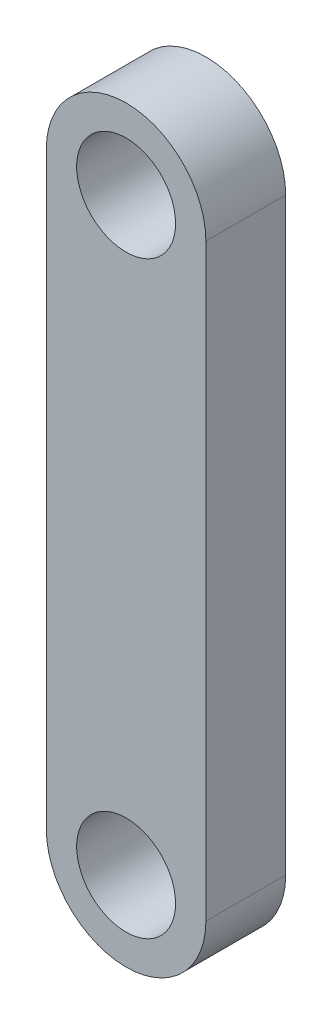
ISO-10303-21;
HEADER;
FILE_DESCRIPTION(('STEP AP214'),'2;1');
FILE_NAME('part.step','',(''),(''),'','','');
FILE_SCHEMA(('AUTOMOTIVE_DESIGN { 1 0 10303 214 1 1 1 1 }'));
ENDSEC;
DATA;
#1=APPLICATION_CONTEXT('core data for automotive mechanical design processes');
#2=APPLICATION_PROTOCOL_DEFINITION('international standard','automotive_design',2000,#1);
#3=PRODUCT_CONTEXT('',#1,'mechanical');
#4=PRODUCT('Part','Part','',(#3));
#5=PRODUCT_RELATED_PRODUCT_CATEGORY('part','',(#4));
#6=PRODUCT_DEFINITION_FORMATION('','',#4);
#7=PRODUCT_DEFINITION_CONTEXT('part definition',#1,'design');
#8=PRODUCT_DEFINITION('design','',#6,#7);
#9=PRODUCT_DEFINITION_SHAPE('','',#8);
#10=(LENGTH_UNIT() NAMED_UNIT(*) SI_UNIT(.MILLI.,.METRE.));
#11=(NAMED_UNIT(*) PLANE_ANGLE_UNIT() SI_UNIT($,.RADIAN.));
#12=(NAMED_UNIT(*) SI_UNIT($,.STERADIAN.) SOLID_ANGLE_UNIT());
#13=UNCERTAINTY_MEASURE_WITH_UNIT(LENGTH_MEASURE(1.E-05),#10,'distance_accuracy_value','');
#14=(GEOMETRIC_REPRESENTATION_CONTEXT(3) GLOBAL_UNCERTAINTY_ASSIGNED_CONTEXT((#13)) GLOBAL_UNIT_ASSIGNED_CONTEXT((#10,
#11,#12)) REPRESENTATION_CONTEXT('',''));
#15=CARTESIAN_POINT('',(0.,0.,0.));
#16=DIRECTION('',(0.,0.,1.));
#17=DIRECTION('',(1.,0.,0.));
#18=AXIS2_PLACEMENT_3D('',#15,#16,#17);
#19=CARTESIAN_POINT('',(0.,33.5030020317063,6.35));
#20=DIRECTION('',(0.,0.,1.));
#21=DIRECTION('',(1.,0.,0.));
#22=AXIS2_PLACEMENT_3D('',#19,#20,#21);
#23=PLANE('',#22);
#24=CARTESIAN_POINT('',(0.,33.5030020317063,6.35));
#25=DIRECTION('',(0.,0.,1.));
#26=DIRECTION('',(1.,0.,0.));
#27=AXIS2_PLACEMENT_3D('',#24,#25,#26);
#28=CIRCLE('',#27,3.937);
#29=CARTESIAN_POINT('',(3.937,33.5030020317063,6.35));
#30=VERTEX_POINT('',#29);
#31=EDGE_CURVE('E99',#30,#30,#28,.T.);
#32=ORIENTED_EDGE('',*,*,#31,.F.);
#33=EDGE_LOOP('',(#32));
#34=FACE_BOUND('',#33,.T.);
#35=CARTESIAN_POINT('',(0.,33.5030020317063,6.35));
#36=DIRECTION('',(0.,0.,1.));
#37=DIRECTION('',(1.,0.,0.));
#38=AXIS2_PLACEMENT_3D('',#35,#36,#37);
#39=CIRCLE('',#38,6.35);
#40=CARTESIAN_POINT('',(6.35,33.5030020317063,6.35));
#41=VERTEX_POINT('',#40);
#42=CARTESIAN_POINT('',(-6.35,33.5030020317063,6.35));
#43=VERTEX_POINT('',#42);
#44=EDGE_CURVE('E84',#41,#43,#39,.T.);
#45=ORIENTED_EDGE('',*,*,#44,.T.);
#46=DIRECTION('',(0.,-1.,0.));
#47=VECTOR('',#46,1.);
#48=CARTESIAN_POINT('',(-6.35,33.5030020317063,6.35));
#49=LINE('',#48,#47);
#50=CARTESIAN_POINT('',(-6.35,-13.3599979682937,6.35));
#51=VERTEX_POINT('',#50);
#52=EDGE_CURVE('E79',#43,#51,#49,.T.);
#53=ORIENTED_EDGE('',*,*,#52,.T.);
#54=CARTESIAN_POINT('',(0.,-13.3599979682937,6.35));
#55=DIRECTION('',(0.,0.,1.));
#56=DIRECTION('',(1.,0.,0.));
#57=AXIS2_PLACEMENT_3D('',#54,#55,#56);
#58=CIRCLE('',#57,6.35);
#59=CARTESIAN_POINT('',(6.35,-13.3599979682937,6.35));
#60=VERTEX_POINT('',#59);
#61=EDGE_CURVE('E82',#51,#60,#58,.T.);
#62=ORIENTED_EDGE('',*,*,#61,.T.);
#63=DIRECTION('',(0.,1.,0.));
#64=VECTOR('',#63,1.);
#65=CARTESIAN_POINT('',(6.35,33.5030020317063,6.35));
#66=LINE('',#65,#64);
#67=EDGE_CURVE('E49',#60,#41,#66,.T.);
#68=ORIENTED_EDGE('',*,*,#67,.T.);
#69=EDGE_LOOP('',(#45,#53,#62,#68));
#70=FACE_BOUND('',#69,.T.);
#71=CARTESIAN_POINT('',(0.,-13.3599979682937,6.35));
#72=DIRECTION('',(0.,0.,1.));
#73=DIRECTION('',(1.,0.,0.));
#74=AXIS2_PLACEMENT_3D('',#71,#72,#73);
#75=CIRCLE('',#74,3.937);
#76=CARTESIAN_POINT('',(3.937,-13.3599979682937,6.35));
#77=VERTEX_POINT('',#76);
#78=EDGE_CURVE('E114',#77,#77,#75,.T.);
#79=ORIENTED_EDGE('',*,*,#78,.F.);
#80=EDGE_LOOP('',(#79));
#81=FACE_BOUND('',#80,.T.);
#82=ADVANCED_FACE('F32',(#34,#70,#81),#23,.T.);
#83=CARTESIAN_POINT('',(0.,33.5030020317063,0.));
#84=DIRECTION('',(0.,0.,1.));
#85=DIRECTION('',(1.,0.,0.));
#86=AXIS2_PLACEMENT_3D('',#83,#84,#85);
#87=PLANE('',#86);
#88=CARTESIAN_POINT('',(0.,33.5030020317063,0.));
#89=DIRECTION('',(0.,0.,1.));
#90=DIRECTION('',(1.,0.,0.));
#91=AXIS2_PLACEMENT_3D('',#88,#89,#90);
#92=CIRCLE('',#91,6.35);
#93=CARTESIAN_POINT('',(6.35,33.5030020317063,0.));
#94=VERTEX_POINT('',#93);
#95=CARTESIAN_POINT('',(-6.35,33.5030020317063,0.));
#96=VERTEX_POINT('',#95);
#97=EDGE_CURVE('E96',#94,#96,#92,.T.);
#98=ORIENTED_EDGE('',*,*,#97,.F.);
#99=DIRECTION('',(0.,1.,0.));
#100=VECTOR('',#99,1.);
#101=CARTESIAN_POINT('',(6.35,33.5030020317063,0.));
#102=LINE('',#101,#100);
#103=CARTESIAN_POINT('',(6.35,-13.3599979682937,0.));
#104=VERTEX_POINT('',#103);
#105=EDGE_CURVE('E72',#104,#94,#102,.T.);
#106=ORIENTED_EDGE('',*,*,#105,.F.);
#107=CARTESIAN_POINT('',(0.,-13.3599979682937,0.));
#108=DIRECTION('',(0.,0.,1.));
#109=DIRECTION('',(1.,0.,0.));
#110=AXIS2_PLACEMENT_3D('',#107,#108,#109);
#111=CIRCLE('',#110,6.35);
#112=CARTESIAN_POINT('',(-6.35,-13.3599979682937,0.));
#113=VERTEX_POINT('',#112);
#114=EDGE_CURVE('E66',#113,#104,#111,.T.);
#115=ORIENTED_EDGE('',*,*,#114,.F.);
#116=DIRECTION('',(0.,-1.,0.));
#117=VECTOR('',#116,1.);
#118=CARTESIAN_POINT('',(-6.35,33.5030020317063,0.));
#119=LINE('',#118,#117);
#120=EDGE_CURVE('E88',#96,#113,#119,.T.);
#121=ORIENTED_EDGE('',*,*,#120,.F.);
#122=EDGE_LOOP('',(#98,#106,#115,#121));
#123=FACE_BOUND('',#122,.T.);
#124=CARTESIAN_POINT('',(0.,33.5030020317063,0.));
#125=DIRECTION('',(0.,0.,1.));
#126=DIRECTION('',(1.,0.,0.));
#127=AXIS2_PLACEMENT_3D('',#124,#125,#126);
#128=CIRCLE('',#127,3.937);
#129=CARTESIAN_POINT('',(3.937,33.5030020317063,0.));
#130=VERTEX_POINT('',#129);
#131=EDGE_CURVE('E111',#130,#130,#128,.T.);
#132=ORIENTED_EDGE('',*,*,#131,.T.);
#133=EDGE_LOOP('',(#132));
#134=FACE_BOUND('',#133,.T.);
#135=CARTESIAN_POINT('',(0.,-13.3599979682937,0.));
#136=DIRECTION('',(0.,0.,1.));
#137=DIRECTION('',(1.,0.,0.));
#138=AXIS2_PLACEMENT_3D('',#135,#136,#137);
#139=CIRCLE('',#138,3.937);
#140=CARTESIAN_POINT('',(3.937,-13.3599979682937,0.));
#141=VERTEX_POINT('',#140);
#142=EDGE_CURVE('E117',#141,#141,#139,.T.);
#143=ORIENTED_EDGE('',*,*,#142,.T.);
#144=EDGE_LOOP('',(#143));
#145=FACE_BOUND('',#144,.T.);
#146=ADVANCED_FACE('F107',(#123,#134,#145),#87,.F.);
#147=CARTESIAN_POINT('',(0.,33.5030020317063,6.35));
#148=DIRECTION('',(0.,0.,-1.));
#149=DIRECTION('',(-1.,0.,0.));
#150=AXIS2_PLACEMENT_3D('',#147,#148,#149);
#151=CYLINDRICAL_SURFACE('',#150,6.35);
#152=ORIENTED_EDGE('',*,*,#97,.T.);
#153=DIRECTION('',(0.,0.,-1.));
#154=VECTOR('',#153,1.);
#155=CARTESIAN_POINT('',(-6.35,33.5030020317063,6.35));
#156=LINE('',#155,#154);
#157=EDGE_CURVE('E11',#43,#96,#156,.T.);
#158=ORIENTED_EDGE('',*,*,#157,.F.);
#159=ORIENTED_EDGE('',*,*,#44,.F.);
#160=DIRECTION('',(0.,0.,-1.));
#161=VECTOR('',#160,1.);
#162=CARTESIAN_POINT('',(6.35,33.5030020317063,6.35));
#163=LINE('',#162,#161);
#164=EDGE_CURVE('E92',#41,#94,#163,.T.);
#165=ORIENTED_EDGE('',*,*,#164,.T.);
#166=EDGE_LOOP('',(#152,#158,#159,#165));
#167=FACE_BOUND('',#166,.T.);
#168=ADVANCED_FACE('F34',(#167),#151,.T.);
#169=CARTESIAN_POINT('',(-6.35,33.5030020317063,6.35));
#170=DIRECTION('',(1.,0.,0.));
#171=DIRECTION('',(0.,1.,0.));
#172=AXIS2_PLACEMENT_3D('',#169,#170,#171);
#173=PLANE('',#172);
#174=ORIENTED_EDGE('',*,*,#120,.T.);
#175=DIRECTION('',(0.,0.,-1.));
#176=VECTOR('',#175,1.);
#177=CARTESIAN_POINT('',(-6.35,-13.3599979682937,6.35));
#178=LINE('',#177,#176);
#179=EDGE_CURVE('E41',#51,#113,#178,.T.);
#180=ORIENTED_EDGE('',*,*,#179,.F.);
#181=ORIENTED_EDGE('',*,*,#52,.F.);
#182=ORIENTED_EDGE('',*,*,#157,.T.);
#183=EDGE_LOOP('',(#174,#180,#181,#182));
#184=FACE_BOUND('',#183,.T.);
#185=ADVANCED_FACE('F87',(#184),#173,.F.);
#186=CARTESIAN_POINT('',(0.,-13.3599979682937,6.35));
#187=DIRECTION('',(0.,0.,-1.));
#188=DIRECTION('',(-1.,0.,0.));
#189=AXIS2_PLACEMENT_3D('',#186,#187,#188);
#190=CYLINDRICAL_SURFACE('',#189,6.35);
#191=ORIENTED_EDGE('',*,*,#114,.T.);
#192=DIRECTION('',(0.,0.,-1.));
#193=VECTOR('',#192,1.);
#194=CARTESIAN_POINT('',(6.35,-13.3599979682937,6.35));
#195=LINE('',#194,#193);
#196=EDGE_CURVE('E89',#60,#104,#195,.T.);
#197=ORIENTED_EDGE('',*,*,#196,.F.);
#198=ORIENTED_EDGE('',*,*,#61,.F.);
#199=ORIENTED_EDGE('',*,*,#179,.T.);
#200=EDGE_LOOP('',(#191,#197,#198,#199));
#201=FACE_BOUND('',#200,.T.);
#202=ADVANCED_FACE('F90',(#201),#190,.T.);
#203=CARTESIAN_POINT('',(6.35,33.5030020317063,6.35));
#204=DIRECTION('',(-1.,0.,0.));
#205=DIRECTION('',(0.,-1.,0.));
#206=AXIS2_PLACEMENT_3D('',#203,#204,#205);
#207=PLANE('',#206);
#208=ORIENTED_EDGE('',*,*,#105,.T.);
#209=ORIENTED_EDGE('',*,*,#164,.F.);
#210=ORIENTED_EDGE('',*,*,#67,.F.);
#211=ORIENTED_EDGE('',*,*,#196,.T.);
#212=EDGE_LOOP('',(#208,#209,#210,#211));
#213=FACE_BOUND('',#212,.T.);
#214=ADVANCED_FACE('F104',(#213),#207,.F.);
#215=CARTESIAN_POINT('',(0.,33.5030020317063,6.35));
#216=DIRECTION('',(0.,0.,-1.));
#217=DIRECTION('',(-1.,0.,0.));
#218=AXIS2_PLACEMENT_3D('',#215,#216,#217);
#219=CYLINDRICAL_SURFACE('',#218,3.937);
#220=ORIENTED_EDGE('',*,*,#31,.T.);
#221=EDGE_LOOP('',(#220));
#222=FACE_BOUND('',#221,.T.);
#223=ORIENTED_EDGE('',*,*,#131,.F.);
#224=EDGE_LOOP('',(#223));
#225=FACE_BOUND('',#224,.T.);
#226=ADVANCED_FACE('F134',(#222,#225),#219,.F.);
#227=CARTESIAN_POINT('',(0.,-13.3599979682937,6.35));
#228=DIRECTION('',(0.,0.,-1.));
#229=DIRECTION('',(-1.,0.,0.));
#230=AXIS2_PLACEMENT_3D('',#227,#228,#229);
#231=CYLINDRICAL_SURFACE('',#230,3.937);
#232=ORIENTED_EDGE('',*,*,#78,.T.);
#233=EDGE_LOOP('',(#232));
#234=FACE_BOUND('',#233,.T.);
#235=ORIENTED_EDGE('',*,*,#142,.F.);
#236=EDGE_LOOP('',(#235));
#237=FACE_BOUND('',#236,.T.);
#238=ADVANCED_FACE('F123',(#234,#237),#231,.F.);
#239=CLOSED_SHELL('',(#82,#146,#168,#185,#202,#214,#226,#238));
#240=MANIFOLD_SOLID_BREP('B2',#239);
#241=ADVANCED_BREP_SHAPE_REPRESENTATION('',(#18,#240),#14);
#242=SHAPE_DEFINITION_REPRESENTATION(#9,#241);
ENDSEC;
END-ISO-10303-21;
